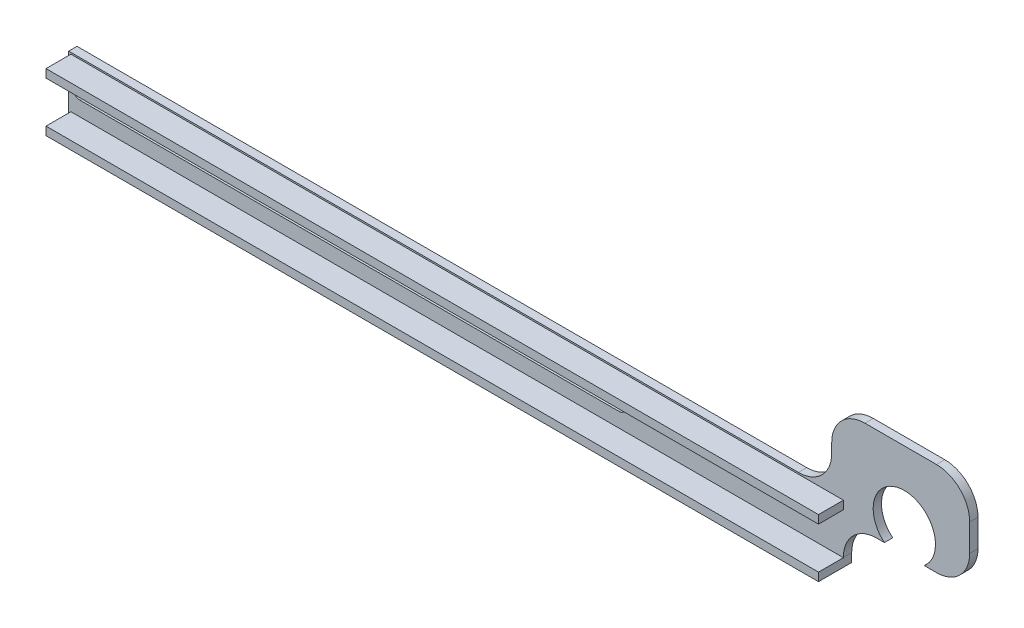
ISO-10303-21;
HEADER;
FILE_DESCRIPTION(('STEP AP214'),'2;1');
FILE_NAME('part.step','',(''),(''),'','','');
FILE_SCHEMA(('AUTOMOTIVE_DESIGN { 1 0 10303 214 1 1 1 1 }'));
ENDSEC;
DATA;
#1=APPLICATION_CONTEXT('core data for automotive mechanical design processes');
#2=APPLICATION_PROTOCOL_DEFINITION('international standard','automotive_design',2000,#1);
#3=PRODUCT_CONTEXT('',#1,'mechanical');
#4=PRODUCT('Part','Part','',(#3));
#5=PRODUCT_RELATED_PRODUCT_CATEGORY('part','',(#4));
#6=PRODUCT_DEFINITION_FORMATION('','',#4);
#7=PRODUCT_DEFINITION_CONTEXT('part definition',#1,'design');
#8=PRODUCT_DEFINITION('design','',#6,#7);
#9=PRODUCT_DEFINITION_SHAPE('','',#8);
#10=(LENGTH_UNIT() NAMED_UNIT(*) SI_UNIT(.MILLI.,.METRE.));
#11=(NAMED_UNIT(*) PLANE_ANGLE_UNIT() SI_UNIT($,.RADIAN.));
#12=(NAMED_UNIT(*) SI_UNIT($,.STERADIAN.) SOLID_ANGLE_UNIT());
#13=UNCERTAINTY_MEASURE_WITH_UNIT(LENGTH_MEASURE(1.E-05),#10,'distance_accuracy_value','');
#14=(GEOMETRIC_REPRESENTATION_CONTEXT(3) GLOBAL_UNCERTAINTY_ASSIGNED_CONTEXT((#13)) GLOBAL_UNIT_ASSIGNED_CONTEXT((#10,
#11,#12)) REPRESENTATION_CONTEXT('',''));
#15=CARTESIAN_POINT('',(0.,0.,0.));
#16=DIRECTION('',(0.,0.,1.));
#17=DIRECTION('',(1.,0.,0.));
#18=AXIS2_PLACEMENT_3D('',#15,#16,#17);
#19=CARTESIAN_POINT('',(0.,0.,-12.4577761138942));
#20=DIRECTION('',(0.,0.,1.));
#21=DIRECTION('',(1.,0.,0.));
#22=AXIS2_PLACEMENT_3D('',#19,#20,#21);
#23=PLANE('',#22);
#24=CARTESIAN_POINT('',(-233.58,17.9282038783923,-12.4577761138942));
#25=DIRECTION('',(0.,0.,1.));
#26=DIRECTION('',(1.,0.,0.));
#27=AXIS2_PLACEMENT_3D('',#24,#25,#26);
#28=CIRCLE('',#27,1.905);
#29=CARTESIAN_POINT('',(-233.58,19.8332038783923,-12.4577761138942));
#30=VERTEX_POINT('',#29);
#31=CARTESIAN_POINT('',(-233.58,16.0232038783923,-12.4577761138942));
#32=VERTEX_POINT('',#31);
#33=EDGE_CURVE('E377',#30,#32,#28,.T.);
#34=ORIENTED_EDGE('',*,*,#33,.F.);
#35=DIRECTION('',(-1.,0.,0.));
#36=VECTOR('',#35,1.);
#37=CARTESIAN_POINT('',(-233.58,19.8332038783923,-12.4577761138942));
#38=LINE('',#37,#36);
#39=CARTESIAN_POINT('',(-68.58,19.8332038783923,-12.4577761138942));
#40=VERTEX_POINT('',#39);
#41=EDGE_CURVE('E382',#40,#30,#38,.T.);
#42=ORIENTED_EDGE('',*,*,#41,.F.);
#43=CARTESIAN_POINT('',(-68.58,17.9282038783923,-12.4577761138942));
#44=DIRECTION('',(0.,0.,1.));
#45=DIRECTION('',(1.,0.,0.));
#46=AXIS2_PLACEMENT_3D('',#43,#44,#45);
#47=CIRCLE('',#46,1.905);
#48=CARTESIAN_POINT('',(-68.58,16.0232038783923,-12.4577761138942));
#49=VERTEX_POINT('',#48);
#50=EDGE_CURVE('E396',#49,#40,#47,.T.);
#51=ORIENTED_EDGE('',*,*,#50,.F.);
#52=DIRECTION('',(1.,0.,0.));
#53=VECTOR('',#52,1.);
#54=CARTESIAN_POINT('',(-233.58,16.0232038783923,-12.4577761138942));
#55=LINE('',#54,#53);
#56=EDGE_CURVE('E393',#32,#49,#55,.T.);
#57=ORIENTED_EDGE('',*,*,#56,.F.);
#58=EDGE_LOOP('',(#34,#42,#51,#57));
#59=FACE_BOUND('',#58,.T.);
#60=DIRECTION('',(1.,0.,0.));
#61=VECTOR('',#60,1.);
#62=CARTESIAN_POINT('',(-236.278650796638,24.2782038783923,-12.4577761138942));
#63=LINE('',#62,#61);
#64=CARTESIAN_POINT('',(-236.278650796638,24.2782038783923,-12.4577761138942));
#65=VERTEX_POINT('',#64);
#66=CARTESIAN_POINT('',(0.,24.2782038783923,-12.4577761138942));
#67=VERTEX_POINT('',#66);
#68=EDGE_CURVE('E354',#65,#67,#63,.T.);
#69=ORIENTED_EDGE('',*,*,#68,.F.);
#70=DIRECTION('',(0.,-1.,0.));
#71=VECTOR('',#70,1.);
#72=CARTESIAN_POINT('',(-236.278650796638,24.2782038783923,-12.4577761138942));
#73=LINE('',#72,#71);
#74=CARTESIAN_POINT('',(-236.278650796638,26.8182038783923,-12.4577761138942));
#75=VERTEX_POINT('',#74);
#76=EDGE_CURVE('E340',#75,#65,#73,.T.);
#77=ORIENTED_EDGE('',*,*,#76,.F.);
#78=DIRECTION('',(-1.,0.,0.));
#79=VECTOR('',#78,1.);
#80=CARTESIAN_POINT('',(-236.278650796638,26.8182038783923,-12.4577761138942));
#81=LINE('',#80,#79);
#82=CARTESIAN_POINT('',(0.,26.8182038783923,-12.4577761138942));
#83=VERTEX_POINT('',#82);
#84=EDGE_CURVE('E345',#83,#75,#81,.T.);
#85=ORIENTED_EDGE('',*,*,#84,.F.);
#86=DIRECTION('',(0.,1.,0.));
#87=VECTOR('',#86,1.);
#88=CARTESIAN_POINT('',(0.,24.2782038783923,-12.4577761138942));
#89=LINE('',#88,#87);
#90=EDGE_CURVE('E356',#67,#83,#89,.T.);
#91=ORIENTED_EDGE('',*,*,#90,.F.);
#92=EDGE_LOOP('',(#69,#77,#85,#91));
#93=FACE_BOUND('',#92,.T.);
#94=DIRECTION('',(1.,0.,0.));
#95=VECTOR('',#94,1.);
#96=CARTESIAN_POINT('',(0.,21.8576281221092,-12.4577761138942));
#97=LINE('',#96,#95);
#98=CARTESIAN_POINT('',(24.7213688446268,21.8576281221092,-12.4577761138942));
#99=VERTEX_POINT('',#98);
#100=CARTESIAN_POINT('',(28.467466088673,21.8576281221092,-12.4577761138942));
#101=VERTEX_POINT('',#100);
#102=EDGE_CURVE('E420',#99,#101,#97,.T.);
#103=ORIENTED_EDGE('',*,*,#102,.T.);
#104=CARTESIAN_POINT('',(28.467466088673,32.0176281221092,-12.4577761138942));
#105=DIRECTION('',(0.,0.,1.));
#106=DIRECTION('',(1.,0.,0.));
#107=AXIS2_PLACEMENT_3D('',#104,#105,#106);
#108=CIRCLE('',#107,10.16);
#109=CARTESIAN_POINT('',(38.627466088673,32.0176281221092,-12.4577761138942));
#110=VERTEX_POINT('',#109);
#111=EDGE_CURVE('E443',#101,#110,#108,.T.);
#112=ORIENTED_EDGE('',*,*,#111,.T.);
#113=DIRECTION('',(0.,-1.,0.));
#114=VECTOR('',#113,1.);
#115=CARTESIAN_POINT('',(38.627466088673,0.,-12.4577761138942));
#116=LINE('',#115,#114);
#117=CARTESIAN_POINT('',(38.627466088673,40.3504366514233,-12.4577761138942));
#118=VERTEX_POINT('',#117);
#119=EDGE_CURVE('E308',#118,#110,#116,.T.);
#120=ORIENTED_EDGE('',*,*,#119,.F.);
#121=CARTESIAN_POINT('',(28.467466088673,40.3504366514233,-12.4577761138942));
#122=DIRECTION('',(0.,0.,1.));
#123=DIRECTION('',(1.,0.,0.));
#124=AXIS2_PLACEMENT_3D('',#121,#122,#123);
#125=CIRCLE('',#124,10.16);
#126=CARTESIAN_POINT('',(28.4674660886729,50.5104366514233,-12.4577761138942));
#127=VERTEX_POINT('',#126);
#128=EDGE_CURVE('E441',#118,#127,#125,.T.);
#129=ORIENTED_EDGE('',*,*,#128,.T.);
#130=DIRECTION('',(1.,0.,0.));
#131=VECTOR('',#130,1.);
#132=CARTESIAN_POINT('',(-3.57403743720038,50.5104366514233,-12.4577761138942));
#133=LINE('',#132,#131);
#134=CARTESIAN_POINT('',(6.58596256279963,50.5104366514233,-12.4577761138942));
#135=VERTEX_POINT('',#134);
#136=EDGE_CURVE('E313',#135,#127,#133,.T.);
#137=ORIENTED_EDGE('',*,*,#136,.F.);
#138=CARTESIAN_POINT('',(6.58596256279963,40.3504366514233,-12.4577761138942));
#139=DIRECTION('',(0.,0.,1.));
#140=DIRECTION('',(1.,0.,0.));
#141=AXIS2_PLACEMENT_3D('',#138,#139,#140);
#142=CIRCLE('',#141,10.16);
#143=CARTESIAN_POINT('',(-3.57403743720037,40.3504366514233,-12.4577761138942));
#144=VERTEX_POINT('',#143);
#145=EDGE_CURVE('E439',#135,#144,#142,.T.);
#146=ORIENTED_EDGE('',*,*,#145,.T.);
#147=DIRECTION('',(0.,1.,0.));
#148=VECTOR('',#147,1.);
#149=CARTESIAN_POINT('',(-3.57403743720035,0.,-12.4577761138942));
#150=LINE('',#149,#148);
#151=CARTESIAN_POINT('',(-3.57403743720036,37.4540639355095,-12.4577761138942));
#152=VERTEX_POINT('',#151);
#153=EDGE_CURVE('E294',#152,#144,#150,.T.);
#154=ORIENTED_EDGE('',*,*,#153,.F.);
#155=CARTESIAN_POINT('',(-13.7340374372004,37.4540639355095,-12.4577761138942));
#156=DIRECTION('',(0.,0.,1.));
#157=DIRECTION('',(1.,0.,0.));
#158=AXIS2_PLACEMENT_3D('',#155,#156,#157);
#159=CIRCLE('',#158,10.16);
#160=CARTESIAN_POINT('',(-13.7340374372004,27.2940639355094,-12.4577761138942));
#161=VERTEX_POINT('',#160);
#162=EDGE_CURVE('E458',#152,#161,#159,.F.);
#163=ORIENTED_EDGE('',*,*,#162,.T.);
#164=DIRECTION('',(1.,0.,0.));
#165=VECTOR('',#164,1.);
#166=CARTESIAN_POINT('',(0.,27.2940639355094,-12.4577761138942));
#167=LINE('',#166,#165);
#168=CARTESIAN_POINT('',(-236.955667324388,27.2940639355094,-12.4577761138942));
#169=VERTEX_POINT('',#168);
#170=EDGE_CURVE('E300',#169,#161,#167,.T.);
#171=ORIENTED_EDGE('',*,*,#170,.F.);
#172=DIRECTION('',(0.,-1.,0.));
#173=VECTOR('',#172,1.);
#174=CARTESIAN_POINT('',(-236.955667324388,0.,-12.4577761138942));
#175=LINE('',#174,#173);
#176=CARTESIAN_POINT('',(-236.955667324388,9.0382038783923,-12.4577761138942));
#177=VERTEX_POINT('',#176);
#178=EDGE_CURVE('E272',#169,#177,#175,.T.);
#179=ORIENTED_EDGE('',*,*,#178,.T.);
#180=DIRECTION('',(1.,0.,0.));
#181=VECTOR('',#180,1.);
#182=CARTESIAN_POINT('',(0.,9.0382038783923,-12.4577761138942));
#183=LINE('',#182,#181);
#184=CARTESIAN_POINT('',(-236.278650796638,9.0382038783923,-12.4577761138942));
#185=VERTEX_POINT('',#184);
#186=EDGE_CURVE('E292',#177,#185,#183,.T.);
#187=ORIENTED_EDGE('',*,*,#186,.T.);
#188=DIRECTION('',(0.,-1.,0.));
#189=VECTOR('',#188,1.);
#190=CARTESIAN_POINT('',(-236.278650796638,11.5782038783923,-12.4577761138942));
#191=LINE('',#190,#189);
#192=CARTESIAN_POINT('',(-236.278650796638,11.5782038783923,-12.4577761138942));
#193=VERTEX_POINT('',#192);
#194=EDGE_CURVE('E305',#193,#185,#191,.T.);
#195=ORIENTED_EDGE('',*,*,#194,.F.);
#196=DIRECTION('',(-1.,0.,0.));
#197=VECTOR('',#196,1.);
#198=CARTESIAN_POINT('',(-236.278650796638,11.5782038783923,-12.4577761138942));
#199=LINE('',#198,#197);
#200=CARTESIAN_POINT('',(0.,11.5782038783923,-12.4577761138942));
#201=VERTEX_POINT('',#200);
#202=EDGE_CURVE('E319',#201,#193,#199,.T.);
#203=ORIENTED_EDGE('',*,*,#202,.F.);
#204=DIRECTION('',(0.,1.,0.));
#205=VECTOR('',#204,1.);
#206=CARTESIAN_POINT('',(0.,-12.1410556627461,-12.4577761138942));
#207=LINE('',#206,#205);
#208=CARTESIAN_POINT('',(0.,11.6976281221092,-12.4577761138942));
#209=VERTEX_POINT('',#208);
#210=EDGE_CURVE('E403',#201,#209,#207,.T.);
#211=ORIENTED_EDGE('',*,*,#210,.T.);
#212=CARTESIAN_POINT('',(10.16,11.6976281221092,-12.4577761138942));
#213=DIRECTION('',(0.,0.,1.));
#214=DIRECTION('',(1.,0.,0.));
#215=AXIS2_PLACEMENT_3D('',#212,#213,#214);
#216=CIRCLE('',#215,10.16);
#217=CARTESIAN_POINT('',(10.16,21.8576281221092,-12.4577761138942));
#218=VERTEX_POINT('',#217);
#219=EDGE_CURVE('E100',#209,#218,#216,.F.);
#220=ORIENTED_EDGE('',*,*,#219,.T.);
#221=CARTESIAN_POINT('',(12.5337036709326,21.8576281221092,-12.4577761138942));
#222=VERTEX_POINT('',#221);
#223=EDGE_CURVE('E414',#218,#222,#97,.T.);
#224=ORIENTED_EDGE('',*,*,#223,.T.);
#225=CARTESIAN_POINT('',(18.6275362577797,29.1782038783923,-12.4577761138942));
#226=DIRECTION('',(0.,0.,1.));
#227=DIRECTION('',(1.,0.,0.));
#228=AXIS2_PLACEMENT_3D('',#225,#226,#227);
#229=CIRCLE('',#228,9.525);
#230=EDGE_CURVE('E417',#99,#222,#229,.T.);
#231=ORIENTED_EDGE('',*,*,#230,.F.);
#232=EDGE_LOOP('',(#103,#112,#120,#129,#137,#146,#154,#163,#171,#179,#187,#195,#203,#211,#220,
#224,#231));
#233=FACE_BOUND('',#232,.T.);
#234=ADVANCED_FACE('F92',(#59,#93,#233),#23,.T.);
#235=CARTESIAN_POINT('',(0.,-12.1410556627461,-14.9977761138942));
#236=DIRECTION('',(1.,0.,0.));
#237=DIRECTION('',(0.,0.,-1.));
#238=AXIS2_PLACEMENT_3D('',#235,#236,#237);
#239=PLANE('',#238);
#240=DIRECTION('',(0.,1.,0.));
#241=VECTOR('',#240,1.);
#242=CARTESIAN_POINT('',(0.,-12.1410556627461,-14.9977761138942));
#243=LINE('',#242,#241);
#244=CARTESIAN_POINT('',(0.,9.0382038783923,-14.9977761138942));
#245=VERTEX_POINT('',#244);
#246=CARTESIAN_POINT('',(0.,11.6976281221092,-14.9977761138942));
#247=VERTEX_POINT('',#246);
#248=EDGE_CURVE('E410',#245,#247,#243,.T.);
#249=ORIENTED_EDGE('',*,*,#248,.T.);
#250=DIRECTION('',(0.,0.,1.));
#251=VECTOR('',#250,1.);
#252=CARTESIAN_POINT('',(0.,11.6976281221092,-12.4577761138942));
#253=LINE('',#252,#251);
#254=EDGE_CURVE('E431',#247,#209,#253,.T.);
#255=ORIENTED_EDGE('',*,*,#254,.T.);
#256=ORIENTED_EDGE('',*,*,#210,.F.);
#257=DIRECTION('',(0.,0.,-1.));
#258=VECTOR('',#257,1.);
#259=CARTESIAN_POINT('',(0.,11.5782038783923,-4.83777611389422));
#260=LINE('',#259,#258);
#261=CARTESIAN_POINT('',(0.,11.5782038783923,-4.83777611389422));
#262=VERTEX_POINT('',#261);
#263=EDGE_CURVE('E332',#262,#201,#260,.T.);
#264=ORIENTED_EDGE('',*,*,#263,.F.);
#265=DIRECTION('',(0.,1.,0.));
#266=VECTOR('',#265,1.);
#267=CARTESIAN_POINT('',(0.,11.5782038783923,-4.83777611389422));
#268=LINE('',#267,#266);
#269=CARTESIAN_POINT('',(0.,9.0382038783923,-4.83777611389422));
#270=VERTEX_POINT('',#269);
#271=EDGE_CURVE('E321',#270,#262,#268,.T.);
#272=ORIENTED_EDGE('',*,*,#271,.F.);
#273=DIRECTION('',(0.,0.,-1.));
#274=VECTOR('',#273,1.);
#275=CARTESIAN_POINT('',(0.,9.0382038783923,-4.83777611389422));
#276=LINE('',#275,#274);
#277=EDGE_CURVE('E335',#270,#245,#276,.T.);
#278=ORIENTED_EDGE('',*,*,#277,.T.);
#279=EDGE_LOOP('',(#249,#255,#256,#264,#272,#278));
#280=FACE_BOUND('',#279,.T.);
#281=ADVANCED_FACE('F476',(#280),#239,.T.);
#282=CARTESIAN_POINT('',(0.,0.,-14.9977761138942));
#283=DIRECTION('',(0.,0.,1.));
#284=DIRECTION('',(1.,0.,0.));
#285=AXIS2_PLACEMENT_3D('',#282,#283,#284);
#286=PLANE('',#285);
#287=DIRECTION('',(-1.,0.,0.));
#288=VECTOR('',#287,1.);
#289=CARTESIAN_POINT('',(-233.58,19.8332038783923,-14.9977761138942));
#290=LINE('',#289,#288);
#291=CARTESIAN_POINT('',(-68.58,19.8332038783923,-14.9977761138942));
#292=VERTEX_POINT('',#291);
#293=CARTESIAN_POINT('',(-233.58,19.8332038783923,-14.9977761138942));
#294=VERTEX_POINT('',#293);
#295=EDGE_CURVE('E388',#292,#294,#290,.T.);
#296=ORIENTED_EDGE('',*,*,#295,.T.);
#297=CARTESIAN_POINT('',(-233.58,17.9282038783923,-14.9977761138942));
#298=DIRECTION('',(0.,0.,1.));
#299=DIRECTION('',(1.,0.,0.));
#300=AXIS2_PLACEMENT_3D('',#297,#298,#299);
#301=CIRCLE('',#300,1.905);
#302=CARTESIAN_POINT('',(-233.58,16.0232038783923,-14.9977761138942));
#303=VERTEX_POINT('',#302);
#304=EDGE_CURVE('E378',#294,#303,#301,.T.);
#305=ORIENTED_EDGE('',*,*,#304,.T.);
#306=DIRECTION('',(1.,0.,0.));
#307=VECTOR('',#306,1.);
#308=CARTESIAN_POINT('',(-233.58,16.0232038783923,-14.9977761138942));
#309=LINE('',#308,#307);
#310=CARTESIAN_POINT('',(-68.58,16.0232038783923,-14.9977761138942));
#311=VERTEX_POINT('',#310);
#312=EDGE_CURVE('E381',#303,#311,#309,.T.);
#313=ORIENTED_EDGE('',*,*,#312,.T.);
#314=CARTESIAN_POINT('',(-68.58,17.9282038783923,-14.9977761138942));
#315=DIRECTION('',(0.,0.,1.));
#316=DIRECTION('',(1.,0.,0.));
#317=AXIS2_PLACEMENT_3D('',#314,#315,#316);
#318=CIRCLE('',#317,1.905);
#319=EDGE_CURVE('E385',#311,#292,#318,.T.);
#320=ORIENTED_EDGE('',*,*,#319,.T.);
#321=EDGE_LOOP('',(#296,#305,#313,#320));
#322=FACE_BOUND('',#321,.T.);
#323=DIRECTION('',(0.,-1.,0.));
#324=VECTOR('',#323,1.);
#325=CARTESIAN_POINT('',(38.627466088673,0.,-14.9977761138942));
#326=LINE('',#325,#324);
#327=CARTESIAN_POINT('',(38.627466088673,40.3504366514233,-14.9977761138942));
#328=VERTEX_POINT('',#327);
#329=CARTESIAN_POINT('',(38.627466088673,32.0176281221092,-14.9977761138942));
#330=VERTEX_POINT('',#329);
#331=EDGE_CURVE('E301',#328,#330,#326,.T.);
#332=ORIENTED_EDGE('',*,*,#331,.T.);
#333=CARTESIAN_POINT('',(28.467466088673,32.0176281221092,-14.9977761138942));
#334=DIRECTION('',(0.,0.,1.));
#335=DIRECTION('',(1.,0.,0.));
#336=AXIS2_PLACEMENT_3D('',#333,#334,#335);
#337=CIRCLE('',#336,10.16);
#338=CARTESIAN_POINT('',(28.467466088673,21.8576281221092,-14.9977761138942));
#339=VERTEX_POINT('',#338);
#340=EDGE_CURVE('E453',#330,#339,#337,.F.);
#341=ORIENTED_EDGE('',*,*,#340,.T.);
#342=DIRECTION('',(1.,0.,0.));
#343=VECTOR('',#342,1.);
#344=CARTESIAN_POINT('',(0.,21.8576281221092,-14.9977761138942));
#345=LINE('',#344,#343);
#346=CARTESIAN_POINT('',(24.7213688446268,21.8576281221092,-14.9977761138942));
#347=VERTEX_POINT('',#346);
#348=EDGE_CURVE('E413',#347,#339,#345,.T.);
#349=ORIENTED_EDGE('',*,*,#348,.F.);
#350=CARTESIAN_POINT('',(18.6275362577797,29.1782038783923,-14.9977761138942));
#351=DIRECTION('',(0.,0.,1.));
#352=DIRECTION('',(1.,0.,0.));
#353=AXIS2_PLACEMENT_3D('',#350,#351,#352);
#354=CIRCLE('',#353,9.525);
#355=CARTESIAN_POINT('',(12.5337036709326,21.8576281221092,-14.9977761138942));
#356=VERTEX_POINT('',#355);
#357=EDGE_CURVE('E369',#347,#356,#354,.T.);
#358=ORIENTED_EDGE('',*,*,#357,.T.);
#359=CARTESIAN_POINT('',(10.16,21.8576281221092,-14.9977761138942));
#360=VERTEX_POINT('',#359);
#361=EDGE_CURVE('E415',#360,#356,#345,.T.);
#362=ORIENTED_EDGE('',*,*,#361,.F.);
#363=CARTESIAN_POINT('',(10.16,11.6976281221092,-14.9977761138942));
#364=DIRECTION('',(0.,0.,1.));
#365=DIRECTION('',(1.,0.,0.));
#366=AXIS2_PLACEMENT_3D('',#363,#364,#365);
#367=CIRCLE('',#366,10.16);
#368=EDGE_CURVE('E12',#360,#247,#367,.T.);
#369=ORIENTED_EDGE('',*,*,#368,.T.);
#370=ORIENTED_EDGE('',*,*,#248,.F.);
#371=DIRECTION('',(1.,0.,0.));
#372=VECTOR('',#371,1.);
#373=CARTESIAN_POINT('',(0.,9.0382038783923,-14.9977761138942));
#374=LINE('',#373,#372);
#375=CARTESIAN_POINT('',(-236.955667324388,9.0382038783923,-14.9977761138942));
#376=VERTEX_POINT('',#375);
#377=EDGE_CURVE('E277',#376,#245,#374,.T.);
#378=ORIENTED_EDGE('',*,*,#377,.F.);
#379=DIRECTION('',(0.,-1.,0.));
#380=VECTOR('',#379,1.);
#381=CARTESIAN_POINT('',(-236.955667324388,0.,-14.9977761138942));
#382=LINE('',#381,#380);
#383=CARTESIAN_POINT('',(-236.955667324388,27.2940639355094,-14.9977761138942));
#384=VERTEX_POINT('',#383);
#385=EDGE_CURVE('E269',#384,#376,#382,.T.);
#386=ORIENTED_EDGE('',*,*,#385,.F.);
#387=DIRECTION('',(1.,0.,0.));
#388=VECTOR('',#387,1.);
#389=CARTESIAN_POINT('',(0.,27.2940639355094,-14.9977761138942));
#390=LINE('',#389,#388);
#391=CARTESIAN_POINT('',(-13.7340374372004,27.2940639355094,-14.9977761138942));
#392=VERTEX_POINT('',#391);
#393=EDGE_CURVE('E280',#384,#392,#390,.T.);
#394=ORIENTED_EDGE('',*,*,#393,.T.);
#395=CARTESIAN_POINT('',(-13.7340374372004,37.4540639355095,-14.9977761138942));
#396=DIRECTION('',(0.,0.,1.));
#397=DIRECTION('',(1.,0.,0.));
#398=AXIS2_PLACEMENT_3D('',#395,#396,#397);
#399=CIRCLE('',#398,10.16);
#400=CARTESIAN_POINT('',(-3.57403743720036,37.4540639355095,-14.9977761138942));
#401=VERTEX_POINT('',#400);
#402=EDGE_CURVE('E460',#392,#401,#399,.T.);
#403=ORIENTED_EDGE('',*,*,#402,.T.);
#404=DIRECTION('',(0.,1.,0.));
#405=VECTOR('',#404,1.);
#406=CARTESIAN_POINT('',(-3.57403743720035,0.,-14.9977761138942));
#407=LINE('',#406,#405);
#408=CARTESIAN_POINT('',(-3.57403743720037,40.3504366514233,-14.9977761138942));
#409=VERTEX_POINT('',#408);
#410=EDGE_CURVE('E285',#401,#409,#407,.T.);
#411=ORIENTED_EDGE('',*,*,#410,.T.);
#412=CARTESIAN_POINT('',(6.58596256279963,40.3504366514233,-14.9977761138942));
#413=DIRECTION('',(0.,0.,1.));
#414=DIRECTION('',(1.,0.,0.));
#415=AXIS2_PLACEMENT_3D('',#412,#413,#414);
#416=CIRCLE('',#415,10.16);
#417=CARTESIAN_POINT('',(6.58596256279963,50.5104366514233,-14.9977761138942));
#418=VERTEX_POINT('',#417);
#419=EDGE_CURVE('E114',#409,#418,#416,.F.);
#420=ORIENTED_EDGE('',*,*,#419,.T.);
#421=DIRECTION('',(1.,0.,0.));
#422=VECTOR('',#421,1.);
#423=CARTESIAN_POINT('',(-3.57403743720038,50.5104366514233,-14.9977761138942));
#424=LINE('',#423,#422);
#425=CARTESIAN_POINT('',(28.4674660886729,50.5104366514233,-14.9977761138942));
#426=VERTEX_POINT('',#425);
#427=EDGE_CURVE('E311',#418,#426,#424,.T.);
#428=ORIENTED_EDGE('',*,*,#427,.T.);
#429=CARTESIAN_POINT('',(28.467466088673,40.3504366514233,-14.9977761138942));
#430=DIRECTION('',(0.,0.,1.));
#431=DIRECTION('',(1.,0.,0.));
#432=AXIS2_PLACEMENT_3D('',#429,#430,#431);
#433=CIRCLE('',#432,10.16);
#434=EDGE_CURVE('E451',#426,#328,#433,.F.);
#435=ORIENTED_EDGE('',*,*,#434,.T.);
#436=EDGE_LOOP('',(#332,#341,#349,#358,#362,#369,#370,#378,#386,#394,#403,#411,#420,#428,#435));
#437=FACE_BOUND('',#436,.T.);
#438=ADVANCED_FACE('F289',(#322,#437),#286,.F.);
#439=CARTESIAN_POINT('',(0.,21.8576281221092,-14.9977761138942));
#440=DIRECTION('',(0.,-1.,0.));
#441=DIRECTION('',(0.,0.,-1.));
#442=AXIS2_PLACEMENT_3D('',#439,#440,#441);
#443=PLANE('',#442);
#444=ORIENTED_EDGE('',*,*,#348,.T.);
#445=DIRECTION('',(0.,0.,1.));
#446=VECTOR('',#445,1.);
#447=CARTESIAN_POINT('',(28.467466088673,21.8576281221092,-12.4577761138942));
#448=LINE('',#447,#446);
#449=EDGE_CURVE('E436',#339,#101,#448,.T.);
#450=ORIENTED_EDGE('',*,*,#449,.T.);
#451=ORIENTED_EDGE('',*,*,#102,.F.);
#452=DIRECTION('',(0.,0.,1.));
#453=VECTOR('',#452,1.);
#454=CARTESIAN_POINT('',(24.7213688446268,21.8576281221092,-31.5077761138942));
#455=LINE('',#454,#453);
#456=EDGE_CURVE('E375',#347,#99,#455,.T.);
#457=ORIENTED_EDGE('',*,*,#456,.F.);
#458=EDGE_LOOP('',(#444,#450,#451,#457));
#459=FACE_BOUND('',#458,.T.);
#460=ADVANCED_FACE('F512',(#459),#443,.T.);
#461=ORIENTED_EDGE('',*,*,#223,.F.);
#462=DIRECTION('',(0.,0.,1.));
#463=VECTOR('',#462,1.);
#464=CARTESIAN_POINT('',(10.16,21.8576281221092,-14.9977761138942));
#465=LINE('',#464,#463);
#466=EDGE_CURVE('E434',#218,#360,#465,.F.);
#467=ORIENTED_EDGE('',*,*,#466,.T.);
#468=ORIENTED_EDGE('',*,*,#361,.T.);
#469=DIRECTION('',(0.,0.,1.));
#470=VECTOR('',#469,1.);
#471=CARTESIAN_POINT('',(12.5337036709326,21.8576281221092,-31.5077761138942));
#472=LINE('',#471,#470);
#473=EDGE_CURVE('E372',#222,#356,#472,.F.);
#474=ORIENTED_EDGE('',*,*,#473,.F.);
#475=EDGE_LOOP('',(#461,#467,#468,#474));
#476=FACE_BOUND('',#475,.T.);
#477=ADVANCED_FACE('F471',(#476),#443,.T.);
#478=CARTESIAN_POINT('',(-233.58,17.9282038783923,-14.9977761138942));
#479=DIRECTION('',(0.,0.,1.));
#480=DIRECTION('',(1.,0.,0.));
#481=AXIS2_PLACEMENT_3D('',#478,#479,#480);
#482=CYLINDRICAL_SURFACE('',#481,1.905);
#483=ORIENTED_EDGE('',*,*,#33,.T.);
#484=DIRECTION('',(0.,0.,1.));
#485=VECTOR('',#484,1.);
#486=CARTESIAN_POINT('',(-233.58,16.0232038783923,-14.9977761138942));
#487=LINE('',#486,#485);
#488=EDGE_CURVE('E391',#303,#32,#487,.T.);
#489=ORIENTED_EDGE('',*,*,#488,.F.);
#490=ORIENTED_EDGE('',*,*,#304,.F.);
#491=DIRECTION('',(0.,0.,1.));
#492=VECTOR('',#491,1.);
#493=CARTESIAN_POINT('',(-233.58,19.8332038783923,-14.9977761138942));
#494=LINE('',#493,#492);
#495=EDGE_CURVE('E401',#294,#30,#494,.T.);
#496=ORIENTED_EDGE('',*,*,#495,.T.);
#497=EDGE_LOOP('',(#483,#489,#490,#496));
#498=FACE_BOUND('',#497,.T.);
#499=ADVANCED_FACE('F544',(#498),#482,.F.);
#500=CARTESIAN_POINT('',(-233.58,19.8332038783923,-14.9977761138942));
#501=DIRECTION('',(0.,1.,0.));
#502=DIRECTION('',(0.,0.,1.));
#503=AXIS2_PLACEMENT_3D('',#500,#501,#502);
#504=PLANE('',#503);
#505=ORIENTED_EDGE('',*,*,#41,.T.);
#506=ORIENTED_EDGE('',*,*,#495,.F.);
#507=ORIENTED_EDGE('',*,*,#295,.F.);
#508=DIRECTION('',(0.,0.,1.));
#509=VECTOR('',#508,1.);
#510=CARTESIAN_POINT('',(-68.58,19.8332038783923,-14.9977761138942));
#511=LINE('',#510,#509);
#512=EDGE_CURVE('E404',#292,#40,#511,.T.);
#513=ORIENTED_EDGE('',*,*,#512,.T.);
#514=EDGE_LOOP('',(#505,#506,#507,#513));
#515=FACE_BOUND('',#514,.T.);
#516=ADVANCED_FACE('F761',(#515),#504,.F.);
#517=CARTESIAN_POINT('',(-68.58,17.9282038783923,-14.9977761138942));
#518=DIRECTION('',(0.,0.,1.));
#519=DIRECTION('',(1.,0.,0.));
#520=AXIS2_PLACEMENT_3D('',#517,#518,#519);
#521=CYLINDRICAL_SURFACE('',#520,1.905);
#522=ORIENTED_EDGE('',*,*,#50,.T.);
#523=ORIENTED_EDGE('',*,*,#512,.F.);
#524=ORIENTED_EDGE('',*,*,#319,.F.);
#525=DIRECTION('',(0.,0.,1.));
#526=VECTOR('',#525,1.);
#527=CARTESIAN_POINT('',(-68.58,16.0232038783923,-14.9977761138942));
#528=LINE('',#527,#526);
#529=EDGE_CURVE('E406',#311,#49,#528,.T.);
#530=ORIENTED_EDGE('',*,*,#529,.T.);
#531=EDGE_LOOP('',(#522,#523,#524,#530));
#532=FACE_BOUND('',#531,.T.);
#533=ADVANCED_FACE('F527',(#532),#521,.F.);
#534=CARTESIAN_POINT('',(-233.58,16.0232038783923,-14.9977761138942));
#535=DIRECTION('',(0.,-1.,0.));
#536=DIRECTION('',(0.,0.,-1.));
#537=AXIS2_PLACEMENT_3D('',#534,#535,#536);
#538=PLANE('',#537);
#539=ORIENTED_EDGE('',*,*,#56,.T.);
#540=ORIENTED_EDGE('',*,*,#529,.F.);
#541=ORIENTED_EDGE('',*,*,#312,.F.);
#542=ORIENTED_EDGE('',*,*,#488,.T.);
#543=EDGE_LOOP('',(#539,#540,#541,#542));
#544=FACE_BOUND('',#543,.T.);
#545=ADVANCED_FACE('F518',(#544),#538,.F.);
#546=CARTESIAN_POINT('',(18.6275362577797,29.1782038783923,-31.5077761138942));
#547=DIRECTION('',(0.,0.,1.));
#548=DIRECTION('',(1.,0.,0.));
#549=AXIS2_PLACEMENT_3D('',#546,#547,#548);
#550=CYLINDRICAL_SURFACE('',#549,9.525);
#551=ORIENTED_EDGE('',*,*,#456,.T.);
#552=ORIENTED_EDGE('',*,*,#230,.T.);
#553=ORIENTED_EDGE('',*,*,#473,.T.);
#554=ORIENTED_EDGE('',*,*,#357,.F.);
#555=EDGE_LOOP('',(#551,#552,#553,#554));
#556=FACE_BOUND('',#555,.T.);
#557=ADVANCED_FACE('F515',(#556),#550,.F.);
#558=CARTESIAN_POINT('',(-236.278650796638,24.2782038783923,-4.83777611389422));
#559=DIRECTION('',(1.,0.,0.));
#560=DIRECTION('',(0.,0.,-1.));
#561=AXIS2_PLACEMENT_3D('',#558,#559,#560);
#562=PLANE('',#561);
#563=ORIENTED_EDGE('',*,*,#76,.T.);
#564=DIRECTION('',(0.,0.,-1.));
#565=VECTOR('',#564,1.);
#566=CARTESIAN_POINT('',(-236.278650796638,24.2782038783923,-4.83777611389422));
#567=LINE('',#566,#565);
#568=CARTESIAN_POINT('',(-236.278650796638,24.2782038783923,-4.83777611389422));
#569=VERTEX_POINT('',#568);
#570=EDGE_CURVE('E367',#569,#65,#567,.T.);
#571=ORIENTED_EDGE('',*,*,#570,.F.);
#572=DIRECTION('',(0.,-1.,0.));
#573=VECTOR('',#572,1.);
#574=CARTESIAN_POINT('',(-236.278650796638,24.2782038783923,-4.83777611389422));
#575=LINE('',#574,#573);
#576=CARTESIAN_POINT('',(-236.278650796638,26.8182038783923,-4.83777611389422));
#577=VERTEX_POINT('',#576);
#578=EDGE_CURVE('E341',#577,#569,#575,.T.);
#579=ORIENTED_EDGE('',*,*,#578,.F.);
#580=DIRECTION('',(0.,0.,-1.));
#581=VECTOR('',#580,1.);
#582=CARTESIAN_POINT('',(-236.278650796638,26.8182038783923,-4.83777611389422));
#583=LINE('',#582,#581);
#584=EDGE_CURVE('E351',#577,#75,#583,.T.);
#585=ORIENTED_EDGE('',*,*,#584,.T.);
#586=EDGE_LOOP('',(#563,#571,#579,#585));
#587=FACE_BOUND('',#586,.T.);
#588=ADVANCED_FACE('F517',(#587),#562,.F.);
#589=CARTESIAN_POINT('',(-236.278650796638,24.2782038783923,-4.83777611389422));
#590=DIRECTION('',(0.,1.,0.));
#591=DIRECTION('',(0.,0.,1.));
#592=AXIS2_PLACEMENT_3D('',#589,#590,#591);
#593=PLANE('',#592);
#594=ORIENTED_EDGE('',*,*,#68,.T.);
#595=DIRECTION('',(0.,0.,-1.));
#596=VECTOR('',#595,1.);
#597=CARTESIAN_POINT('',(0.,24.2782038783923,-4.83777611389422));
#598=LINE('',#597,#596);
#599=CARTESIAN_POINT('',(0.,24.2782038783923,-4.83777611389422));
#600=VERTEX_POINT('',#599);
#601=EDGE_CURVE('E364',#600,#67,#598,.T.);
#602=ORIENTED_EDGE('',*,*,#601,.F.);
#603=DIRECTION('',(1.,0.,0.));
#604=VECTOR('',#603,1.);
#605=CARTESIAN_POINT('',(-236.278650796638,24.2782038783923,-4.83777611389422));
#606=LINE('',#605,#604);
#607=EDGE_CURVE('E344',#569,#600,#606,.T.);
#608=ORIENTED_EDGE('',*,*,#607,.F.);
#609=ORIENTED_EDGE('',*,*,#570,.T.);
#610=EDGE_LOOP('',(#594,#602,#608,#609));
#611=FACE_BOUND('',#610,.T.);
#612=ADVANCED_FACE('F524',(#611),#593,.F.);
#613=CARTESIAN_POINT('',(0.,24.2782038783923,-4.83777611389422));
#614=DIRECTION('',(-1.,0.,0.));
#615=DIRECTION('',(0.,0.,1.));
#616=AXIS2_PLACEMENT_3D('',#613,#614,#615);
#617=PLANE('',#616);
#618=ORIENTED_EDGE('',*,*,#90,.T.);
#619=DIRECTION('',(0.,0.,-1.));
#620=VECTOR('',#619,1.);
#621=CARTESIAN_POINT('',(0.,26.8182038783923,-4.83777611389422));
#622=LINE('',#621,#620);
#623=CARTESIAN_POINT('',(0.,26.8182038783923,-4.83777611389422));
#624=VERTEX_POINT('',#623);
#625=EDGE_CURVE('E362',#624,#83,#622,.T.);
#626=ORIENTED_EDGE('',*,*,#625,.F.);
#627=DIRECTION('',(0.,1.,0.));
#628=VECTOR('',#627,1.);
#629=CARTESIAN_POINT('',(0.,24.2782038783923,-4.83777611389422));
#630=LINE('',#629,#628);
#631=EDGE_CURVE('E347',#600,#624,#630,.T.);
#632=ORIENTED_EDGE('',*,*,#631,.F.);
#633=ORIENTED_EDGE('',*,*,#601,.T.);
#634=EDGE_LOOP('',(#618,#626,#632,#633));
#635=FACE_BOUND('',#634,.T.);
#636=ADVANCED_FACE('F719',(#635),#617,.F.);
#637=CARTESIAN_POINT('',(-236.278650796638,26.8182038783923,-4.83777611389422));
#638=DIRECTION('',(0.,-1.,0.));
#639=DIRECTION('',(0.,0.,-1.));
#640=AXIS2_PLACEMENT_3D('',#637,#638,#639);
#641=PLANE('',#640);
#642=ORIENTED_EDGE('',*,*,#84,.T.);
#643=ORIENTED_EDGE('',*,*,#584,.F.);
#644=DIRECTION('',(-1.,0.,0.));
#645=VECTOR('',#644,1.);
#646=CARTESIAN_POINT('',(-236.278650796638,26.8182038783923,-4.83777611389422));
#647=LINE('',#646,#645);
#648=EDGE_CURVE('E349',#624,#577,#647,.T.);
#649=ORIENTED_EDGE('',*,*,#648,.F.);
#650=ORIENTED_EDGE('',*,*,#625,.T.);
#651=EDGE_LOOP('',(#642,#643,#649,#650));
#652=FACE_BOUND('',#651,.T.);
#653=ADVANCED_FACE('F709',(#652),#641,.F.);
#654=CARTESIAN_POINT('',(0.,0.,-4.83777611389422));
#655=DIRECTION('',(0.,0.,-1.));
#656=DIRECTION('',(-1.,0.,0.));
#657=AXIS2_PLACEMENT_3D('',#654,#655,#656);
#658=PLANE('',#657);
#659=ORIENTED_EDGE('',*,*,#578,.T.);
#660=ORIENTED_EDGE('',*,*,#607,.T.);
#661=ORIENTED_EDGE('',*,*,#631,.T.);
#662=ORIENTED_EDGE('',*,*,#648,.T.);
#663=EDGE_LOOP('',(#659,#660,#661,#662));
#664=FACE_BOUND('',#663,.T.);
#665=ADVANCED_FACE('F683',(#664),#658,.F.);
#666=CARTESIAN_POINT('',(-236.278650796638,11.5782038783923,-4.83777611389422));
#667=DIRECTION('',(1.,0.,0.));
#668=DIRECTION('',(0.,0.,-1.));
#669=AXIS2_PLACEMENT_3D('',#666,#667,#668);
#670=PLANE('',#669);
#671=ORIENTED_EDGE('',*,*,#194,.T.);
#672=DIRECTION('',(0.,0.,-1.));
#673=VECTOR('',#672,1.);
#674=CARTESIAN_POINT('',(-236.278650796638,9.0382038783923,-4.83777611389422));
#675=LINE('',#674,#673);
#676=CARTESIAN_POINT('',(-236.278650796638,9.0382038783923,-4.83777611389422));
#677=VERTEX_POINT('',#676);
#678=EDGE_CURVE('E337',#677,#185,#675,.T.);
#679=ORIENTED_EDGE('',*,*,#678,.F.);
#680=DIRECTION('',(0.,-1.,0.));
#681=VECTOR('',#680,1.);
#682=CARTESIAN_POINT('',(-236.278650796638,11.5782038783923,-4.83777611389422));
#683=LINE('',#682,#681);
#684=CARTESIAN_POINT('',(-236.278650796638,11.5782038783923,-4.83777611389422));
#685=VERTEX_POINT('',#684);
#686=EDGE_CURVE('E315',#685,#677,#683,.T.);
#687=ORIENTED_EDGE('',*,*,#686,.F.);
#688=DIRECTION('',(0.,0.,-1.));
#689=VECTOR('',#688,1.);
#690=CARTESIAN_POINT('',(-236.278650796638,11.5782038783923,-4.83777611389422));
#691=LINE('',#690,#689);
#692=EDGE_CURVE('E325',#685,#193,#691,.T.);
#693=ORIENTED_EDGE('',*,*,#692,.T.);
#694=EDGE_LOOP('',(#671,#679,#687,#693));
#695=FACE_BOUND('',#694,.T.);
#696=ADVANCED_FACE('F672',(#695),#670,.F.);
#697=CARTESIAN_POINT('',(-236.278650796638,9.0382038783923,-4.83777611389422));
#698=DIRECTION('',(0.,1.,0.));
#699=DIRECTION('',(0.,0.,1.));
#700=AXIS2_PLACEMENT_3D('',#697,#698,#699);
#701=PLANE('',#700);
#702=ORIENTED_EDGE('',*,*,#678,.T.);
#703=ORIENTED_EDGE('',*,*,#186,.F.);
#704=DIRECTION('',(0.,0.,1.));
#705=VECTOR('',#704,1.);
#706=CARTESIAN_POINT('',(-236.955667324388,9.0382038783923,-14.9977761138942));
#707=LINE('',#706,#705);
#708=EDGE_CURVE('E276',#376,#177,#707,.T.);
#709=ORIENTED_EDGE('',*,*,#708,.F.);
#710=ORIENTED_EDGE('',*,*,#377,.T.);
#711=ORIENTED_EDGE('',*,*,#277,.F.);
#712=DIRECTION('',(1.,0.,0.));
#713=VECTOR('',#712,1.);
#714=CARTESIAN_POINT('',(-236.278650796638,9.0382038783923,-4.83777611389422));
#715=LINE('',#714,#713);
#716=EDGE_CURVE('E318',#677,#270,#715,.T.);
#717=ORIENTED_EDGE('',*,*,#716,.F.);
#718=EDGE_LOOP('',(#702,#703,#709,#710,#711,#717));
#719=FACE_BOUND('',#718,.T.);
#720=ADVANCED_FACE('F481',(#719),#701,.F.);
#721=CARTESIAN_POINT('',(-236.278650796638,11.5782038783923,-4.83777611389422));
#722=DIRECTION('',(0.,-1.,0.));
#723=DIRECTION('',(0.,0.,-1.));
#724=AXIS2_PLACEMENT_3D('',#721,#722,#723);
#725=PLANE('',#724);
#726=ORIENTED_EDGE('',*,*,#202,.T.);
#727=ORIENTED_EDGE('',*,*,#692,.F.);
#728=DIRECTION('',(-1.,0.,0.));
#729=VECTOR('',#728,1.);
#730=CARTESIAN_POINT('',(-236.278650796638,11.5782038783923,-4.83777611389422));
#731=LINE('',#730,#729);
#732=EDGE_CURVE('E323',#262,#685,#731,.T.);
#733=ORIENTED_EDGE('',*,*,#732,.F.);
#734=ORIENTED_EDGE('',*,*,#263,.T.);
#735=EDGE_LOOP('',(#726,#727,#733,#734));
#736=FACE_BOUND('',#735,.T.);
#737=ADVANCED_FACE('F671',(#736),#725,.F.);
#738=CARTESIAN_POINT('',(0.,0.,-4.83777611389422));
#739=DIRECTION('',(0.,0.,1.));
#740=DIRECTION('',(1.,0.,0.));
#741=AXIS2_PLACEMENT_3D('',#738,#739,#740);
#742=PLANE('',#741);
#743=ORIENTED_EDGE('',*,*,#686,.T.);
#744=ORIENTED_EDGE('',*,*,#716,.T.);
#745=ORIENTED_EDGE('',*,*,#271,.T.);
#746=ORIENTED_EDGE('',*,*,#732,.T.);
#747=EDGE_LOOP('',(#743,#744,#745,#746));
#748=FACE_BOUND('',#747,.T.);
#749=ADVANCED_FACE('F616',(#748),#742,.T.);
#750=CARTESIAN_POINT('',(-3.57403743720035,0.,-14.9977761138942));
#751=DIRECTION('',(1.,0.,0.));
#752=DIRECTION('',(0.,1.,0.));
#753=AXIS2_PLACEMENT_3D('',#750,#751,#752);
#754=PLANE('',#753);
#755=ORIENTED_EDGE('',*,*,#410,.F.);
#756=DIRECTION('',(0.,0.,1.));
#757=VECTOR('',#756,1.);
#758=CARTESIAN_POINT('',(-3.57403743720036,37.4540639355095,-12.4577761138942));
#759=LINE('',#758,#757);
#760=EDGE_CURVE('E427',#401,#152,#759,.T.);
#761=ORIENTED_EDGE('',*,*,#760,.T.);
#762=ORIENTED_EDGE('',*,*,#153,.T.);
#763=DIRECTION('',(0.,0.,-1.));
#764=VECTOR('',#763,1.);
#765=CARTESIAN_POINT('',(-3.57403743720037,40.3504366514233,-14.9977761138942));
#766=LINE('',#765,#764);
#767=EDGE_CURVE('E424',#144,#409,#766,.T.);
#768=ORIENTED_EDGE('',*,*,#767,.T.);
#769=EDGE_LOOP('',(#755,#761,#762,#768));
#770=FACE_BOUND('',#769,.T.);
#771=ADVANCED_FACE('F488',(#770),#754,.F.);
#772=CARTESIAN_POINT('',(0.,27.2940639355094,-14.9977761138942));
#773=DIRECTION('',(0.,-1.,0.));
#774=DIRECTION('',(0.,0.,-1.));
#775=AXIS2_PLACEMENT_3D('',#772,#773,#774);
#776=PLANE('',#775);
#777=ORIENTED_EDGE('',*,*,#170,.T.);
#778=DIRECTION('',(0.,0.,1.));
#779=VECTOR('',#778,1.);
#780=CARTESIAN_POINT('',(-13.7340374372004,27.2940639355094,-14.9977761138942));
#781=LINE('',#780,#779);
#782=EDGE_CURVE('E283',#161,#392,#781,.F.);
#783=ORIENTED_EDGE('',*,*,#782,.T.);
#784=ORIENTED_EDGE('',*,*,#393,.F.);
#785=DIRECTION('',(0.,0.,1.));
#786=VECTOR('',#785,1.);
#787=CARTESIAN_POINT('',(-236.955667324388,27.2940639355094,-14.9977761138942));
#788=LINE('',#787,#786);
#789=EDGE_CURVE('E264',#384,#169,#788,.T.);
#790=ORIENTED_EDGE('',*,*,#789,.T.);
#791=EDGE_LOOP('',(#777,#783,#784,#790));
#792=FACE_BOUND('',#791,.T.);
#793=ADVANCED_FACE('F281',(#792),#776,.F.);
#794=CARTESIAN_POINT('',(-236.955667324388,0.,-14.9977761138942));
#795=DIRECTION('',(-1.,0.,0.));
#796=DIRECTION('',(0.,0.,1.));
#797=AXIS2_PLACEMENT_3D('',#794,#795,#796);
#798=PLANE('',#797);
#799=ORIENTED_EDGE('',*,*,#178,.F.);
#800=ORIENTED_EDGE('',*,*,#789,.F.);
#801=ORIENTED_EDGE('',*,*,#385,.T.);
#802=ORIENTED_EDGE('',*,*,#708,.T.);
#803=EDGE_LOOP('',(#799,#800,#801,#802));
#804=FACE_BOUND('',#803,.T.);
#805=ADVANCED_FACE('F266',(#804),#798,.T.);
#806=CARTESIAN_POINT('',(38.627466088673,0.,-14.9977761138942));
#807=DIRECTION('',(-1.,0.,0.));
#808=DIRECTION('',(0.,-1.,0.));
#809=AXIS2_PLACEMENT_3D('',#806,#807,#808);
#810=PLANE('',#809);
#811=ORIENTED_EDGE('',*,*,#119,.T.);
#812=DIRECTION('',(0.,0.,1.));
#813=VECTOR('',#812,1.);
#814=CARTESIAN_POINT('',(38.627466088673,32.0176281221092,-14.9977761138942));
#815=LINE('',#814,#813);
#816=EDGE_CURVE('E448',#110,#330,#815,.F.);
#817=ORIENTED_EDGE('',*,*,#816,.T.);
#818=ORIENTED_EDGE('',*,*,#331,.F.);
#819=DIRECTION('',(0.,0.,1.));
#820=VECTOR('',#819,1.);
#821=CARTESIAN_POINT('',(38.627466088673,40.3504366514233,-14.9977761138942));
#822=LINE('',#821,#820);
#823=EDGE_CURVE('E445',#328,#118,#822,.T.);
#824=ORIENTED_EDGE('',*,*,#823,.T.);
#825=EDGE_LOOP('',(#811,#817,#818,#824));
#826=FACE_BOUND('',#825,.T.);
#827=ADVANCED_FACE('F502',(#826),#810,.F.);
#828=CARTESIAN_POINT('',(-3.57403743720038,50.5104366514233,-14.9977761138942));
#829=DIRECTION('',(0.,-1.,0.));
#830=DIRECTION('',(0.,0.,-1.));
#831=AXIS2_PLACEMENT_3D('',#828,#829,#830);
#832=PLANE('',#831);
#833=ORIENTED_EDGE('',*,*,#136,.T.);
#834=DIRECTION('',(0.,0.,1.));
#835=VECTOR('',#834,1.);
#836=CARTESIAN_POINT('',(28.467466088673,50.5104366514233,-14.9977761138942));
#837=LINE('',#836,#835);
#838=EDGE_CURVE('E107',#127,#426,#837,.F.);
#839=ORIENTED_EDGE('',*,*,#838,.T.);
#840=ORIENTED_EDGE('',*,*,#427,.F.);
#841=DIRECTION('',(0.,0.,-1.));
#842=VECTOR('',#841,1.);
#843=CARTESIAN_POINT('',(6.58596256279964,50.5104366514233,-14.9977761138942));
#844=LINE('',#843,#842);
#845=EDGE_CURVE('E455',#418,#135,#844,.F.);
#846=ORIENTED_EDGE('',*,*,#845,.T.);
#847=EDGE_LOOP('',(#833,#839,#840,#846));
#848=FACE_BOUND('',#847,.T.);
#849=ADVANCED_FACE('F494',(#848),#832,.F.);
#850=CARTESIAN_POINT('',(-13.7340374372004,37.4540639355095,-14.9977761138942));
#851=DIRECTION('',(0.,0.,-1.));
#852=DIRECTION('',(-1.,0.,0.));
#853=AXIS2_PLACEMENT_3D('',#850,#851,#852);
#854=CYLINDRICAL_SURFACE('',#853,10.16);
#855=ORIENTED_EDGE('',*,*,#402,.F.);
#856=ORIENTED_EDGE('',*,*,#782,.F.);
#857=ORIENTED_EDGE('',*,*,#162,.F.);
#858=ORIENTED_EDGE('',*,*,#760,.F.);
#859=EDGE_LOOP('',(#855,#856,#857,#858));
#860=FACE_BOUND('',#859,.T.);
#861=ADVANCED_FACE('F484',(#860),#854,.F.);
#862=CARTESIAN_POINT('',(10.16,11.6976281221092,-14.9977761138942));
#863=DIRECTION('',(0.,0.,-1.));
#864=DIRECTION('',(-1.,0.,0.));
#865=AXIS2_PLACEMENT_3D('',#862,#863,#864);
#866=CYLINDRICAL_SURFACE('',#865,10.16);
#867=ORIENTED_EDGE('',*,*,#368,.F.);
#868=ORIENTED_EDGE('',*,*,#466,.F.);
#869=ORIENTED_EDGE('',*,*,#219,.F.);
#870=ORIENTED_EDGE('',*,*,#254,.F.);
#871=EDGE_LOOP('',(#867,#868,#869,#870));
#872=FACE_BOUND('',#871,.T.);
#873=ADVANCED_FACE('F474',(#872),#866,.F.);
#874=CARTESIAN_POINT('',(28.467466088673,32.0176281221092,-14.9977761138942));
#875=DIRECTION('',(0.,0.,-1.));
#876=DIRECTION('',(-1.,0.,0.));
#877=AXIS2_PLACEMENT_3D('',#874,#875,#876);
#878=CYLINDRICAL_SURFACE('',#877,10.16);
#879=ORIENTED_EDGE('',*,*,#340,.F.);
#880=ORIENTED_EDGE('',*,*,#816,.F.);
#881=ORIENTED_EDGE('',*,*,#111,.F.);
#882=ORIENTED_EDGE('',*,*,#449,.F.);
#883=EDGE_LOOP('',(#879,#880,#881,#882));
#884=FACE_BOUND('',#883,.T.);
#885=ADVANCED_FACE('F509',(#884),#878,.T.);
#886=CARTESIAN_POINT('',(28.467466088673,40.3504366514233,-14.9977761138942));
#887=DIRECTION('',(0.,0.,1.));
#888=DIRECTION('',(1.,0.,0.));
#889=AXIS2_PLACEMENT_3D('',#886,#887,#888);
#890=CYLINDRICAL_SURFACE('',#889,10.16);
#891=ORIENTED_EDGE('',*,*,#434,.F.);
#892=ORIENTED_EDGE('',*,*,#838,.F.);
#893=ORIENTED_EDGE('',*,*,#128,.F.);
#894=ORIENTED_EDGE('',*,*,#823,.F.);
#895=EDGE_LOOP('',(#891,#892,#893,#894));
#896=FACE_BOUND('',#895,.T.);
#897=ADVANCED_FACE('F499',(#896),#890,.T.);
#898=CARTESIAN_POINT('',(6.58596256279963,40.3504366514233,-14.9977761138942));
#899=DIRECTION('',(0.,0.,-1.));
#900=DIRECTION('',(-1.,0.,0.));
#901=AXIS2_PLACEMENT_3D('',#898,#899,#900);
#902=CYLINDRICAL_SURFACE('',#901,10.16);
#903=ORIENTED_EDGE('',*,*,#145,.F.);
#904=ORIENTED_EDGE('',*,*,#845,.F.);
#905=ORIENTED_EDGE('',*,*,#419,.F.);
#906=ORIENTED_EDGE('',*,*,#767,.F.);
#907=EDGE_LOOP('',(#903,#904,#905,#906));
#908=FACE_BOUND('',#907,.T.);
#909=ADVANCED_FACE('F94',(#908),#902,.T.);
#910=CLOSED_SHELL('',(#234,#281,#438,#460,#477,#499,#516,#533,#545,#557,#588,#612,#636,#653,
#665,#696,#720,#737,#749,#771,#793,#805,#827,#849,#861,#873,#885,#897,#909));
#911=MANIFOLD_SOLID_BREP('B2',#910);
#912=ADVANCED_BREP_SHAPE_REPRESENTATION('',(#18,#911),#14);
#913=SHAPE_DEFINITION_REPRESENTATION(#9,#912);
ENDSEC;
END-ISO-10303-21;
